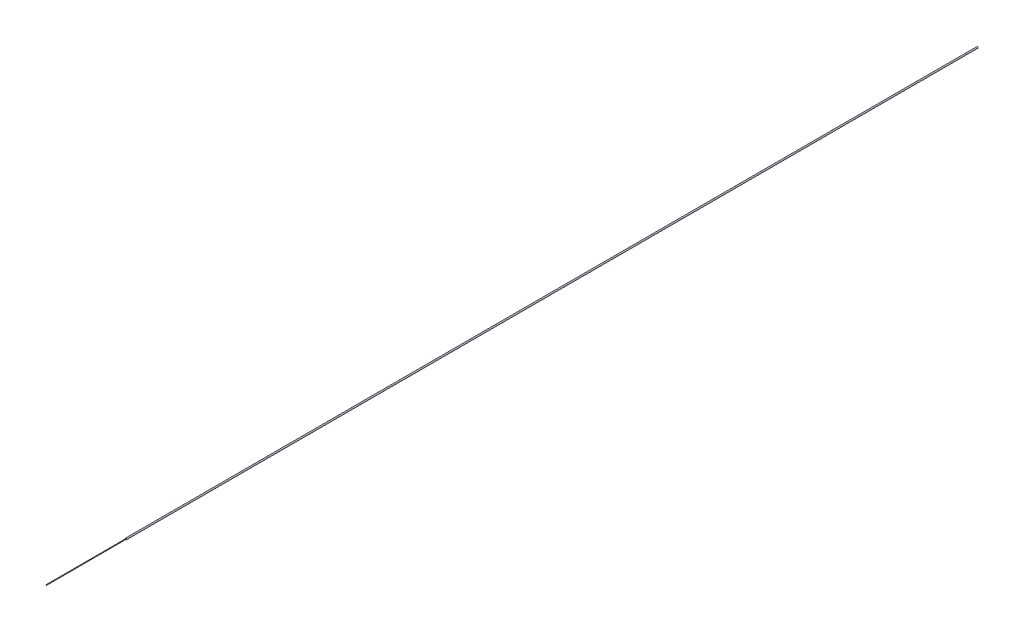
ISO-10303-21;
HEADER;
FILE_DESCRIPTION(('STEP AP214'),'2;1');
FILE_NAME('part.step','',(''),(''),'','','');
FILE_SCHEMA(('AUTOMOTIVE_DESIGN { 1 0 10303 214 1 1 1 1 }'));
ENDSEC;
DATA;
#1=APPLICATION_CONTEXT('core data for automotive mechanical design processes');
#2=APPLICATION_PROTOCOL_DEFINITION('international standard','automotive_design',2000,#1);
#3=PRODUCT_CONTEXT('',#1,'mechanical');
#4=PRODUCT('Part','Part','',(#3));
#5=PRODUCT_RELATED_PRODUCT_CATEGORY('part','',(#4));
#6=PRODUCT_DEFINITION_FORMATION('','',#4);
#7=PRODUCT_DEFINITION_CONTEXT('part definition',#1,'design');
#8=PRODUCT_DEFINITION('design','',#6,#7);
#9=PRODUCT_DEFINITION_SHAPE('','',#8);
#10=(LENGTH_UNIT() NAMED_UNIT(*) SI_UNIT(.MILLI.,.METRE.));
#11=(NAMED_UNIT(*) PLANE_ANGLE_UNIT() SI_UNIT($,.RADIAN.));
#12=(NAMED_UNIT(*) SI_UNIT($,.STERADIAN.) SOLID_ANGLE_UNIT());
#13=UNCERTAINTY_MEASURE_WITH_UNIT(LENGTH_MEASURE(1.E-05),#10,'distance_accuracy_value','');
#14=(GEOMETRIC_REPRESENTATION_CONTEXT(3) GLOBAL_UNCERTAINTY_ASSIGNED_CONTEXT((#13)) GLOBAL_UNIT_ASSIGNED_CONTEXT((#10,
#11,#12)) REPRESENTATION_CONTEXT('',''));
#15=CARTESIAN_POINT('',(0.,0.,0.));
#16=DIRECTION('',(0.,0.,1.));
#17=DIRECTION('',(1.,0.,0.));
#18=AXIS2_PLACEMENT_3D('',#15,#16,#17);
#19=CARTESIAN_POINT('',(0.,0.,1389.));
#20=DIRECTION('',(0.,0.,-1.));
#21=DIRECTION('',(-1.,0.,0.));
#22=AXIS2_PLACEMENT_3D('',#19,#20,#21);
#23=CYLINDRICAL_SURFACE('',#22,1.143);
#24=CARTESIAN_POINT('',(0.,0.,1389.));
#25=DIRECTION('',(0.,0.,1.));
#26=DIRECTION('',(1.,0.,0.));
#27=AXIS2_PLACEMENT_3D('',#24,#25,#26);
#28=CIRCLE('',#27,1.143);
#29=CARTESIAN_POINT('',(1.143,0.,1389.));
#30=VERTEX_POINT('',#29);
#31=EDGE_CURVE('E11',#30,#30,#28,.T.);
#32=ORIENTED_EDGE('',*,*,#31,.F.);
#33=EDGE_LOOP('',(#32));
#34=FACE_BOUND('',#33,.T.);
#35=CARTESIAN_POINT('',(0.,0.,0.));
#36=DIRECTION('',(0.,0.,1.));
#37=DIRECTION('',(1.,0.,0.));
#38=AXIS2_PLACEMENT_3D('',#35,#36,#37);
#39=CIRCLE('',#38,1.143);
#40=CARTESIAN_POINT('',(1.143,0.,0.));
#41=VERTEX_POINT('',#40);
#42=EDGE_CURVE('E44',#41,#41,#39,.T.);
#43=ORIENTED_EDGE('',*,*,#42,.T.);
#44=EDGE_LOOP('',(#43));
#45=FACE_BOUND('',#44,.T.);
#46=ADVANCED_FACE('F41',(#34,#45),#23,.T.);
#47=CARTESIAN_POINT('',(0.,0.,1389.));
#48=DIRECTION('',(0.,0.,1.));
#49=DIRECTION('',(1.,0.,0.));
#50=AXIS2_PLACEMENT_3D('',#47,#48,#49);
#51=PLANE('',#50);
#52=CARTESIAN_POINT('',(0.,0.,1389.));
#53=DIRECTION('',(0.,0.,-1.));
#54=DIRECTION('',(-1.,0.,0.));
#55=AXIS2_PLACEMENT_3D('',#52,#53,#54);
#56=CIRCLE('',#55,0.5);
#57=CARTESIAN_POINT('',(-0.5,0.,1389.));
#58=VERTEX_POINT('',#57);
#59=EDGE_CURVE('E51',#58,#58,#56,.T.);
#60=ORIENTED_EDGE('',*,*,#59,.T.);
#61=EDGE_LOOP('',(#60));
#62=FACE_BOUND('',#61,.T.);
#63=ORIENTED_EDGE('',*,*,#31,.T.);
#64=EDGE_LOOP('',(#63));
#65=FACE_BOUND('',#64,.T.);
#66=ADVANCED_FACE('F59',(#62,#65),#51,.T.);
#67=CARTESIAN_POINT('',(0.,0.,0.));
#68=DIRECTION('',(0.,0.,1.));
#69=DIRECTION('',(1.,0.,0.));
#70=AXIS2_PLACEMENT_3D('',#67,#68,#69);
#71=PLANE('',#70);
#72=ORIENTED_EDGE('',*,*,#42,.F.);
#73=EDGE_LOOP('',(#72));
#74=FACE_BOUND('',#73,.T.);
#75=ADVANCED_FACE('F69',(#74),#71,.F.);
#76=CARTESIAN_POINT('',(0.181767049721836,-5.11165184254499E-13,1518.99987292586));
#77=DIRECTION('',(0.,0.,-1.));
#78=DIRECTION('',(-1.,0.,0.));
#79=AXIS2_PLACEMENT_3D('',#76,#77,#78);
#80=PLANE('',#79);
#81=CARTESIAN_POINT('',(0.181767049721836,-5.11165184254499E-13,1518.99987292586));
#82=DIRECTION('',(0.,0.,-1.));
#83=DIRECTION('',(-1.,0.,0.));
#84=AXIS2_PLACEMENT_3D('',#81,#82,#83);
#85=CIRCLE('',#84,0.5);
#86=CARTESIAN_POINT('',(-0.318232950278164,-5.11165184254499E-13,1518.99987292586));
#87=VERTEX_POINT('',#86);
#88=EDGE_CURVE('E53',#87,#87,#85,.T.);
#89=ORIENTED_EDGE('',*,*,#88,.F.);
#90=EDGE_LOOP('',(#89));
#91=FACE_BOUND('',#90,.T.);
#92=ADVANCED_FACE('F64',(#91),#80,.F.);
#93=CARTESIAN_POINT('',(-0.5,0.,1389.));
#94=CARTESIAN_POINT('',(-0.318232950278164,-5.11165184254499E-13,1518.99987292586));
#95=CARTESIAN_POINT('',(-0.5,1.,1389.));
#96=CARTESIAN_POINT('',(-0.318232950278164,0.999999999999489,1518.99987292586));
#97=CARTESIAN_POINT('',(0.5,1.,1389.));
#98=CARTESIAN_POINT('',(0.681767049721836,0.999999999999489,1518.99987292586));
#99=CARTESIAN_POINT('',(0.5,0.,1389.));
#100=CARTESIAN_POINT('',(0.681767049721836,-5.11103951914541E-13,1518.99987292586));
#101=CARTESIAN_POINT('',(0.5,-1.,1389.));
#102=CARTESIAN_POINT('',(0.681767049721836,-1.00000000000051,1518.99987292586));
#103=CARTESIAN_POINT('',(-0.5,-1.,1389.));
#104=CARTESIAN_POINT('',(-0.318232950278164,-1.00000000000051,1518.99987292586));
#105=CARTESIAN_POINT('',(-0.5,0.,1389.));
#106=CARTESIAN_POINT('',(-0.318232950278164,-5.11165184254499E-13,1518.99987292586));
#107=(BOUNDED_SURFACE() B_SPLINE_SURFACE(3,1,((#93,#94),(#95,#96),(#97,#98),(#99,#100),(#101,
#102),(#103,#104),(#105,#106)),.UNSPECIFIED.,.T.,.F.,.F.) B_SPLINE_SURFACE_WITH_KNOTS((4,3,4),
(2,2),(0.,0.5,1.),(0.,1.),
.UNSPECIFIED.) GEOMETRIC_REPRESENTATION_ITEM() RATIONAL_B_SPLINE_SURFACE(((1.,1.),
(0.333333333333333,0.333333333333333),(0.333333333333333,0.333333333333333),(1.,1.),
(0.333333333333333,0.333333333333333),(0.333333333333333,0.333333333333333),(1.,1.))) REPRESENTATION_ITEM('') SURFACE());
#108=CARTESIAN_POINT('',(-0.5,0.,1389.));
#109=CARTESIAN_POINT('',(-0.498106593232064,0.,1390.35416534298));
#110=CARTESIAN_POINT('',(-0.496213186464128,0.,1391.70833068596));
#111=CARTESIAN_POINT('',(-0.492426372928257,0.,1394.41666137191));
#112=CARTESIAN_POINT('',(-0.490532966160321,0.,1395.77082671489));
#113=CARTESIAN_POINT('',(-0.48674615262445,0.,1398.47915740084));
#114=CARTESIAN_POINT('',(-0.484852745856514,0.,1399.83332274382));
#115=CARTESIAN_POINT('',(-0.481065932320642,0.,1402.54165342978));
#116=CARTESIAN_POINT('',(-0.479172525552706,0.,1403.89581877275));
#117=CARTESIAN_POINT('',(-0.475385712016835,0.,1406.60414945871));
#118=CARTESIAN_POINT('',(-0.473492305248899,0.,1407.95831480169));
#119=CARTESIAN_POINT('',(-0.469705491713027,0.,1410.66664548764));
#120=CARTESIAN_POINT('',(-0.467812084945092,0.,1412.02081083062));
#121=CARTESIAN_POINT('',(-0.46402527140922,-1.01168109383703E-13,1414.72914151658));
#122=CARTESIAN_POINT('',(-0.462131864641284,-1.06492746719687E-13,1416.08330685955));
#123=CARTESIAN_POINT('',(-0.458345051105413,-1.17142021391656E-13,1418.79163754551));
#124=CARTESIAN_POINT('',(-0.456451644337477,-1.2246665872764E-13,1420.14580288849));
#125=CARTESIAN_POINT('',(-0.452664830801605,-1.33115933399609E-13,1422.85413357444));
#126=CARTESIAN_POINT('',(-0.450771424033669,-1.38440570735594E-13,1424.20829891742));
#127=CARTESIAN_POINT('',(-0.446984610497798,-1.49089845407562E-13,1426.91662960338));
#128=CARTESIAN_POINT('',(-0.445091203729862,-1.54414482743546E-13,1428.27079494635));
#129=CARTESIAN_POINT('',(-0.441304390193991,-1.65063757415515E-13,1430.97912563231));
#130=CARTESIAN_POINT('',(-0.439410983426055,-1.703883947515E-13,1432.33329097529));
#131=CARTESIAN_POINT('',(-0.435624169890183,-1.81037669423468E-13,1435.04162166124));
#132=CARTESIAN_POINT('',(-0.433730763122247,-1.86362306759453E-13,1436.39578700422));
#133=CARTESIAN_POINT('',(-0.429943949586376,-1.97011581431421E-13,1439.10411769018));
#134=CARTESIAN_POINT('',(-0.42805054281844,-2.02336218767405E-13,1440.45828303315));
#135=CARTESIAN_POINT('',(-0.424263729282569,-2.12985493439374E-13,1443.16661371911));
#136=CARTESIAN_POINT('',(-0.422370322514633,-2.18310130775359E-13,1444.52077906209));
#137=CARTESIAN_POINT('',(-0.418583508978761,-2.28959405447328E-13,1447.22910974804));
#138=CARTESIAN_POINT('',(-0.416690102210825,-2.34284042783312E-13,1448.58327509102));
#139=CARTESIAN_POINT('',(-0.412903288674954,-2.44933317455281E-13,1451.29160577697));
#140=CARTESIAN_POINT('',(-0.411009881907018,-2.50257954791265E-13,1452.64577111995));
#141=CARTESIAN_POINT('',(-0.407223068371146,-2.60907229463234E-13,1455.35410180591));
#142=CARTESIAN_POINT('',(-0.405329661603211,-2.66231866799218E-13,1456.70826714889));
#143=CARTESIAN_POINT('',(-0.401542848067339,-2.76881141471187E-13,1459.41659783484));
#144=CARTESIAN_POINT('',(-0.399649441299403,-2.82205778807171E-13,1460.77076317782));
#145=CARTESIAN_POINT('',(-0.395862627763532,-2.9285505347914E-13,1463.47909386377));
#146=CARTESIAN_POINT('',(-0.393969220995596,-2.98179690815124E-13,1464.83325920675));
#147=CARTESIAN_POINT('',(-0.390182407459724,-3.08828965487093E-13,1467.54158989271));
#148=CARTESIAN_POINT('',(-0.388289000691788,-3.14153602823078E-13,1468.89575523568));
#149=CARTESIAN_POINT('',(-0.384502187155917,-3.24802877495046E-13,1471.60408592164));
#150=CARTESIAN_POINT('',(-0.382608780387981,-3.3012751483103E-13,1472.95825126462));
#151=CARTESIAN_POINT('',(-0.37882196685211,-3.40776789502999E-13,1475.66658195057));
#152=CARTESIAN_POINT('',(-0.376928560084174,-3.46101426838983E-13,1477.02074729355));
#153=CARTESIAN_POINT('',(-0.373141746548302,-3.56750701510952E-13,1479.72907797951));
#154=CARTESIAN_POINT('',(-0.371248339780366,-3.62075338846937E-13,1481.08324332248));
#155=CARTESIAN_POINT('',(-0.367461526244495,-3.72724613518905E-13,1483.79157400844));
#156=CARTESIAN_POINT('',(-0.365568119476559,-3.7804925085489E-13,1485.14573935142));
#157=CARTESIAN_POINT('',(-0.361781305940688,-3.88698525526858E-13,1487.85407003737));
#158=CARTESIAN_POINT('',(-0.359887899172752,-3.94023162862843E-13,1489.20823538035));
#159=CARTESIAN_POINT('',(-0.35610108563688,-4.04672437534812E-13,1491.91656606631));
#160=CARTESIAN_POINT('',(-0.354207678868944,-4.09997074870796E-13,1493.27073140928));
#161=CARTESIAN_POINT('',(-0.350420865333073,-4.20646349542765E-13,1495.97906209524));
#162=CARTESIAN_POINT('',(-0.348527458565137,-4.25970986878749E-13,1497.33322743822));
#163=CARTESIAN_POINT('',(-0.344740645029265,-4.36620261550718E-13,1500.04155812417));
#164=CARTESIAN_POINT('',(-0.342847238261329,-4.41944898886702E-13,1501.39572346715));
#165=CARTESIAN_POINT('',(-0.339060424725458,-4.52594173558671E-13,1504.1040541531));
#166=CARTESIAN_POINT('',(-0.337167017957522,-4.57918810894655E-13,1505.45821949608));
#167=CARTESIAN_POINT('',(-0.333380204421651,-4.68568085566624E-13,1508.16655018204));
#168=CARTESIAN_POINT('',(-0.331486797653715,-4.73892722902608E-13,1509.52071552502));
#169=CARTESIAN_POINT('',(-0.327699984117843,-4.84541997574577E-13,1512.22904621097));
#170=CARTESIAN_POINT('',(-0.325806577349907,-4.89866634910561E-13,1513.58321155395));
#171=CARTESIAN_POINT('',(-0.322019763814036,-5.0051590958253E-13,1516.2915422399));
#172=CARTESIAN_POINT('',(-0.3201263570461,-5.05840546918514E-13,1517.64570758288));
#173=CARTESIAN_POINT('',(-0.318232950278164,-5.11165184254499E-13,1518.99987292586));
#174=B_SPLINE_CURVE_WITH_KNOTS('',3,(#108,#109,#110,#111,#112,#113,#114,#115,#116,#117,#118,
#119,#120,#121,#122,#123,#124,#125,#126,#127,#128,#129,#130,#131,#132,#133,#134,#135,#136,#137,
#138,#139,#140,#141,#142,#143,#144,#145,#146,#147,#148,#149,#150,#151,#152,#153,#154,#155,#156,
#157,#158,#159,#160,#161,#162,#163,#164,#165,#166,#167,#168,#169,#170,#171,#172,#173),
.UNSPECIFIED.,.F.,.F.,(4,2,2,2,2,2,2,2,2,2,2,2,2,2,2,2,2,2,2,2,2,2,2,2,2,2,2,2,2,2,2,2,4),(0.,
4.06249999999994,8.1250000000001,12.1875,16.25,20.3124999999999,24.3749999999998,28.4375,
32.4999999999999,36.5624999999999,40.625,44.6875,48.7499999999999,52.8125000000001,
56.8749999999998,60.9375,65.0000000000001,69.0625000000001,73.125,77.1875,81.2499999999999,
85.3125000000001,89.375,93.4375,97.5000000000001,101.5625,105.625,109.6875,113.75,117.8125,
121.875,125.9375,130.),.UNSPECIFIED.);
#175=EDGE_CURVE('',#58,#87,#174,.T.);
#176=ORIENTED_EDGE('',*,*,#59,.F.);
#177=ORIENTED_EDGE('',*,*,#88,.T.);
#178=ORIENTED_EDGE('',*,*,#175,.T.);
#179=ORIENTED_EDGE('',*,*,#175,.F.);
#180=EDGE_LOOP('',(#176,#178,#177,#179));
#181=FACE_BOUND('',#180,.T.);
#182=ADVANCED_FACE('F61',(#181),#107,.F.);
#183=CLOSED_SHELL('',(#46,#66,#75,#92,#182));
#184=MANIFOLD_SOLID_BREP('B2',#183);
#185=ADVANCED_BREP_SHAPE_REPRESENTATION('',(#18,#184),#14);
#186=SHAPE_DEFINITION_REPRESENTATION(#9,#185);
ENDSEC;
END-ISO-10303-21;
